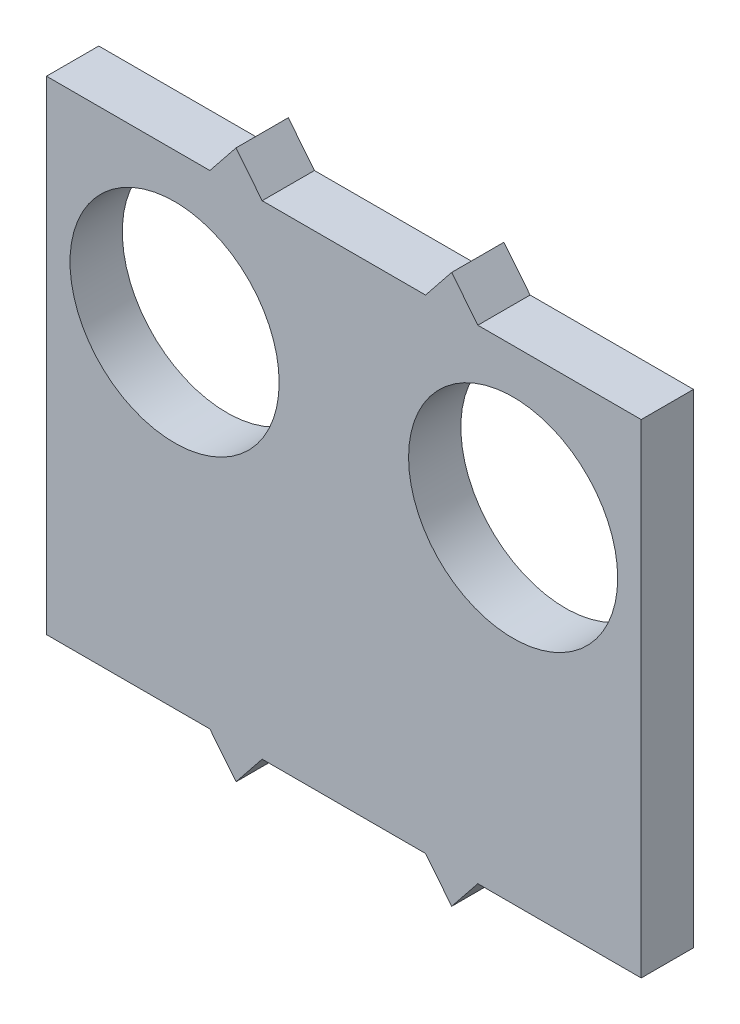
ISO-10303-21;
HEADER;
FILE_DESCRIPTION(('STEP AP214'),'2;1');
FILE_NAME('part.step','',(''),(''),'','','');
FILE_SCHEMA(('AUTOMOTIVE_DESIGN { 1 0 10303 214 1 1 1 1 }'));
ENDSEC;
DATA;
#1=APPLICATION_CONTEXT('core data for automotive mechanical design processes');
#2=APPLICATION_PROTOCOL_DEFINITION('international standard','automotive_design',2000,#1);
#3=PRODUCT_CONTEXT('',#1,'mechanical');
#4=PRODUCT('Part','Part','',(#3));
#5=PRODUCT_RELATED_PRODUCT_CATEGORY('part','',(#4));
#6=PRODUCT_DEFINITION_FORMATION('','',#4);
#7=PRODUCT_DEFINITION_CONTEXT('part definition',#1,'design');
#8=PRODUCT_DEFINITION('design','',#6,#7);
#9=PRODUCT_DEFINITION_SHAPE('','',#8);
#10=(LENGTH_UNIT() NAMED_UNIT(*) SI_UNIT(.MILLI.,.METRE.));
#11=(NAMED_UNIT(*) PLANE_ANGLE_UNIT() SI_UNIT($,.RADIAN.));
#12=(NAMED_UNIT(*) SI_UNIT($,.STERADIAN.) SOLID_ANGLE_UNIT());
#13=UNCERTAINTY_MEASURE_WITH_UNIT(LENGTH_MEASURE(1.E-05),#10,'distance_accuracy_value','');
#14=(GEOMETRIC_REPRESENTATION_CONTEXT(3) GLOBAL_UNCERTAINTY_ASSIGNED_CONTEXT((#13)) GLOBAL_UNIT_ASSIGNED_CONTEXT((#10,
#11,#12)) REPRESENTATION_CONTEXT('',''));
#15=CARTESIAN_POINT('',(0.,0.,0.));
#16=DIRECTION('',(0.,0.,1.));
#17=DIRECTION('',(1.,0.,0.));
#18=AXIS2_PLACEMENT_3D('',#15,#16,#17);
#19=CARTESIAN_POINT('',(0.,0.,4.));
#20=DIRECTION('',(0.,1.,0.));
#21=DIRECTION('',(0.,0.,1.));
#22=AXIS2_PLACEMENT_3D('',#19,#20,#21);
#23=PLANE('',#22);
#24=DIRECTION('',(1.,0.,0.));
#25=VECTOR('',#24,1.);
#26=CARTESIAN_POINT('',(0.,0.,0.));
#27=LINE('',#26,#25);
#28=CARTESIAN_POINT('',(0.,0.,0.));
#29=VERTEX_POINT('',#28);
#30=CARTESIAN_POINT('',(12.5,0.,0.));
#31=VERTEX_POINT('',#30);
#32=EDGE_CURVE('E224',#29,#31,#27,.T.);
#33=ORIENTED_EDGE('',*,*,#32,.T.);
#34=DIRECTION('',(0.,0.,-1.));
#35=VECTOR('',#34,1.);
#36=CARTESIAN_POINT('',(12.5,0.,4.));
#37=LINE('',#36,#35);
#38=CARTESIAN_POINT('',(12.5,0.,4.));
#39=VERTEX_POINT('',#38);
#40=EDGE_CURVE('E11',#39,#31,#37,.T.);
#41=ORIENTED_EDGE('',*,*,#40,.F.);
#42=DIRECTION('',(1.,0.,0.));
#43=VECTOR('',#42,1.);
#44=CARTESIAN_POINT('',(0.,0.,4.));
#45=LINE('',#44,#43);
#46=CARTESIAN_POINT('',(0.,0.,4.));
#47=VERTEX_POINT('',#46);
#48=EDGE_CURVE('E203',#47,#39,#45,.T.);
#49=ORIENTED_EDGE('',*,*,#48,.F.);
#50=DIRECTION('',(0.,0.,-1.));
#51=VECTOR('',#50,1.);
#52=CARTESIAN_POINT('',(0.,0.,4.));
#53=LINE('',#52,#51);
#54=EDGE_CURVE('E59',#47,#29,#53,.T.);
#55=ORIENTED_EDGE('',*,*,#54,.T.);
#56=EDGE_LOOP('',(#33,#41,#49,#55));
#57=FACE_BOUND('',#56,.T.);
#58=ADVANCED_FACE('F42',(#57),#23,.F.);
#59=CARTESIAN_POINT('',(7.6219512195122,6.09756097560976,4.));
#60=DIRECTION('',(0.78086880944303,0.624695047554424,0.));
#61=DIRECTION('',(-0.624695047554424,0.78086880944303,0.));
#62=AXIS2_PLACEMENT_3D('',#59,#60,#61);
#63=PLANE('',#62);
#64=DIRECTION('',(0.624695047554424,-0.78086880944303,0.));
#65=VECTOR('',#64,1.);
#66=CARTESIAN_POINT('',(7.6219512195122,6.09756097560976,0.));
#67=LINE('',#66,#65);
#68=CARTESIAN_POINT('',(14.5,-2.5,0.));
#69=VERTEX_POINT('',#68);
#70=EDGE_CURVE('E341',#31,#69,#67,.T.);
#71=ORIENTED_EDGE('',*,*,#70,.T.);
#72=DIRECTION('',(0.,0.,-1.));
#73=VECTOR('',#72,1.);
#74=CARTESIAN_POINT('',(14.5,-2.5,4.));
#75=LINE('',#74,#73);
#76=CARTESIAN_POINT('',(14.5,-2.5,4.));
#77=VERTEX_POINT('',#76);
#78=EDGE_CURVE('E51',#77,#69,#75,.T.);
#79=ORIENTED_EDGE('',*,*,#78,.F.);
#80=DIRECTION('',(0.624695047554424,-0.78086880944303,0.));
#81=VECTOR('',#80,1.);
#82=CARTESIAN_POINT('',(7.6219512195122,6.09756097560976,4.));
#83=LINE('',#82,#81);
#84=EDGE_CURVE('E121',#39,#77,#83,.T.);
#85=ORIENTED_EDGE('',*,*,#84,.F.);
#86=ORIENTED_EDGE('',*,*,#40,.T.);
#87=EDGE_LOOP('',(#71,#79,#85,#86));
#88=FACE_BOUND('',#87,.T.);
#89=ADVANCED_FACE('F44',(#88),#63,.F.);
#90=CARTESIAN_POINT('',(10.0609756097561,-8.04878048780488,4.));
#91=DIRECTION('',(-0.780868809443031,0.624695047554424,0.));
#92=DIRECTION('',(-0.624695047554424,-0.780868809443031,0.));
#93=AXIS2_PLACEMENT_3D('',#90,#91,#92);
#94=PLANE('',#93);
#95=DIRECTION('',(0.624695047554424,0.780868809443031,0.));
#96=VECTOR('',#95,1.);
#97=CARTESIAN_POINT('',(10.0609756097561,-8.04878048780488,0.));
#98=LINE('',#97,#96);
#99=CARTESIAN_POINT('',(16.5,0.,0.));
#100=VERTEX_POINT('',#99);
#101=EDGE_CURVE('E339',#69,#100,#98,.T.);
#102=ORIENTED_EDGE('',*,*,#101,.T.);
#103=DIRECTION('',(0.,0.,-1.));
#104=VECTOR('',#103,1.);
#105=CARTESIAN_POINT('',(16.5,0.,4.));
#106=LINE('',#105,#104);
#107=CARTESIAN_POINT('',(16.5,0.,4.));
#108=VERTEX_POINT('',#107);
#109=EDGE_CURVE('E332',#108,#100,#106,.T.);
#110=ORIENTED_EDGE('',*,*,#109,.F.);
#111=DIRECTION('',(0.624695047554424,0.780868809443031,0.));
#112=VECTOR('',#111,1.);
#113=CARTESIAN_POINT('',(10.0609756097561,-8.04878048780488,4.));
#114=LINE('',#113,#112);
#115=EDGE_CURVE('E210',#77,#108,#114,.T.);
#116=ORIENTED_EDGE('',*,*,#115,.F.);
#117=ORIENTED_EDGE('',*,*,#78,.T.);
#118=EDGE_LOOP('',(#102,#110,#116,#117));
#119=FACE_BOUND('',#118,.T.);
#120=ADVANCED_FACE('F257',(#119),#94,.F.);
#121=CARTESIAN_POINT('',(29.,0.,0.));
#122=VERTEX_POINT('',#121);
#123=EDGE_CURVE('E288',#100,#122,#27,.T.);
#124=ORIENTED_EDGE('',*,*,#123,.T.);
#125=DIRECTION('',(0.,0.,-1.));
#126=VECTOR('',#125,1.);
#127=CARTESIAN_POINT('',(29.,0.,4.));
#128=LINE('',#127,#126);
#129=CARTESIAN_POINT('',(29.,0.,4.));
#130=VERTEX_POINT('',#129);
#131=EDGE_CURVE('E330',#130,#122,#128,.T.);
#132=ORIENTED_EDGE('',*,*,#131,.F.);
#133=EDGE_CURVE('E202',#108,#130,#45,.T.);
#134=ORIENTED_EDGE('',*,*,#133,.F.);
#135=ORIENTED_EDGE('',*,*,#109,.T.);
#136=EDGE_LOOP('',(#124,#132,#134,#135));
#137=FACE_BOUND('',#136,.T.);
#138=ADVANCED_FACE('F252',(#137),#23,.F.);
#139=CARTESIAN_POINT('',(17.6829268292683,14.1463414634146,4.));
#140=DIRECTION('',(-0.78086880944303,-0.624695047554424,0.));
#141=DIRECTION('',(0.624695047554424,-0.78086880944303,0.));
#142=AXIS2_PLACEMENT_3D('',#139,#140,#141);
#143=PLANE('',#142);
#144=DIRECTION('',(-0.624695047554424,0.78086880944303,0.));
#145=VECTOR('',#144,1.);
#146=CARTESIAN_POINT('',(17.6829268292683,14.1463414634146,0.));
#147=LINE('',#146,#145);
#148=CARTESIAN_POINT('',(31.,-2.5,0.));
#149=VERTEX_POINT('',#148);
#150=EDGE_CURVE('E345',#149,#122,#147,.T.);
#151=ORIENTED_EDGE('',*,*,#150,.F.);
#152=DIRECTION('',(0.,0.,-1.));
#153=VECTOR('',#152,1.);
#154=CARTESIAN_POINT('',(31.,-2.5,4.));
#155=LINE('',#154,#153);
#156=CARTESIAN_POINT('',(31.,-2.5,4.));
#157=VERTEX_POINT('',#156);
#158=EDGE_CURVE('E328',#157,#149,#155,.T.);
#159=ORIENTED_EDGE('',*,*,#158,.F.);
#160=DIRECTION('',(-0.624695047554424,0.78086880944303,0.));
#161=VECTOR('',#160,1.);
#162=CARTESIAN_POINT('',(17.6829268292683,14.1463414634146,4.));
#163=LINE('',#162,#161);
#164=EDGE_CURVE('E207',#157,#130,#163,.T.);
#165=ORIENTED_EDGE('',*,*,#164,.T.);
#166=ORIENTED_EDGE('',*,*,#131,.T.);
#167=EDGE_LOOP('',(#151,#159,#165,#166));
#168=FACE_BOUND('',#167,.T.);
#169=ADVANCED_FACE('F261',(#168),#143,.T.);
#170=CARTESIAN_POINT('',(20.1219512195122,-16.0975609756098,4.));
#171=DIRECTION('',(0.78086880944303,-0.624695047554424,0.));
#172=DIRECTION('',(0.624695047554424,0.78086880944303,0.));
#173=AXIS2_PLACEMENT_3D('',#170,#171,#172);
#174=PLANE('',#173);
#175=DIRECTION('',(-0.624695047554424,-0.78086880944303,0.));
#176=VECTOR('',#175,1.);
#177=CARTESIAN_POINT('',(20.1219512195122,-16.0975609756098,0.));
#178=LINE('',#177,#176);
#179=CARTESIAN_POINT('',(33.,0.,0.));
#180=VERTEX_POINT('',#179);
#181=EDGE_CURVE('E286',#180,#149,#178,.T.);
#182=ORIENTED_EDGE('',*,*,#181,.F.);
#183=DIRECTION('',(0.,0.,-1.));
#184=VECTOR('',#183,1.);
#185=CARTESIAN_POINT('',(33.,0.,4.));
#186=LINE('',#185,#184);
#187=CARTESIAN_POINT('',(33.,0.,4.));
#188=VERTEX_POINT('',#187);
#189=EDGE_CURVE('E280',#188,#180,#186,.T.);
#190=ORIENTED_EDGE('',*,*,#189,.F.);
#191=DIRECTION('',(-0.624695047554424,-0.78086880944303,0.));
#192=VECTOR('',#191,1.);
#193=CARTESIAN_POINT('',(20.1219512195122,-16.0975609756098,4.));
#194=LINE('',#193,#192);
#195=EDGE_CURVE('E200',#188,#157,#194,.T.);
#196=ORIENTED_EDGE('',*,*,#195,.T.);
#197=ORIENTED_EDGE('',*,*,#158,.T.);
#198=EDGE_LOOP('',(#182,#190,#196,#197));
#199=FACE_BOUND('',#198,.T.);
#200=ADVANCED_FACE('F265',(#199),#174,.T.);
#201=CARTESIAN_POINT('',(45.5,0.,0.));
#202=VERTEX_POINT('',#201);
#203=EDGE_CURVE('E276',#180,#202,#27,.T.);
#204=ORIENTED_EDGE('',*,*,#203,.T.);
#205=DIRECTION('',(0.,0.,-1.));
#206=VECTOR('',#205,1.);
#207=CARTESIAN_POINT('',(45.5,0.,4.));
#208=LINE('',#207,#206);
#209=CARTESIAN_POINT('',(45.5,0.,4.));
#210=VERTEX_POINT('',#209);
#211=EDGE_CURVE('E279',#210,#202,#208,.T.);
#212=ORIENTED_EDGE('',*,*,#211,.F.);
#213=EDGE_CURVE('E197',#188,#210,#45,.T.);
#214=ORIENTED_EDGE('',*,*,#213,.F.);
#215=ORIENTED_EDGE('',*,*,#189,.T.);
#216=EDGE_LOOP('',(#204,#212,#214,#215));
#217=FACE_BOUND('',#216,.T.);
#218=ADVANCED_FACE('F253',(#217),#23,.F.);
#219=CARTESIAN_POINT('',(45.5,0.,4.));
#220=DIRECTION('',(-1.,0.,0.));
#221=DIRECTION('',(0.,0.,1.));
#222=AXIS2_PLACEMENT_3D('',#219,#220,#221);
#223=PLANE('',#222);
#224=DIRECTION('',(0.,1.,0.));
#225=VECTOR('',#224,1.);
#226=CARTESIAN_POINT('',(45.5,0.,0.));
#227=LINE('',#226,#225);
#228=CARTESIAN_POINT('',(45.5,37.,0.));
#229=VERTEX_POINT('',#228);
#230=EDGE_CURVE('E285',#202,#229,#227,.T.);
#231=ORIENTED_EDGE('',*,*,#230,.T.);
#232=DIRECTION('',(0.,0.,-1.));
#233=VECTOR('',#232,1.);
#234=CARTESIAN_POINT('',(45.5,37.,4.));
#235=LINE('',#234,#233);
#236=CARTESIAN_POINT('',(45.5,37.,4.));
#237=VERTEX_POINT('',#236);
#238=EDGE_CURVE('E291',#237,#229,#235,.T.);
#239=ORIENTED_EDGE('',*,*,#238,.F.);
#240=DIRECTION('',(0.,1.,0.));
#241=VECTOR('',#240,1.);
#242=CARTESIAN_POINT('',(45.5,0.,4.));
#243=LINE('',#242,#241);
#244=EDGE_CURVE('E194',#210,#237,#243,.T.);
#245=ORIENTED_EDGE('',*,*,#244,.F.);
#246=ORIENTED_EDGE('',*,*,#211,.T.);
#247=EDGE_LOOP('',(#231,#239,#245,#246));
#248=FACE_BOUND('',#247,.T.);
#249=ADVANCED_FACE('F264',(#248),#223,.F.);
#250=CARTESIAN_POINT('',(0.,37.,4.));
#251=DIRECTION('',(0.,1.,0.));
#252=DIRECTION('',(-1.,0.,0.));
#253=AXIS2_PLACEMENT_3D('',#250,#251,#252);
#254=PLANE('',#253);
#255=DIRECTION('',(1.,0.,0.));
#256=VECTOR('',#255,1.);
#257=CARTESIAN_POINT('',(0.,37.,0.));
#258=LINE('',#257,#256);
#259=CARTESIAN_POINT('',(33.,37.,0.));
#260=VERTEX_POINT('',#259);
#261=EDGE_CURVE('E295',#260,#229,#258,.T.);
#262=ORIENTED_EDGE('',*,*,#261,.F.);
#263=DIRECTION('',(0.,0.,-1.));
#264=VECTOR('',#263,1.);
#265=CARTESIAN_POINT('',(33.,37.,4.));
#266=LINE('',#265,#264);
#267=CARTESIAN_POINT('',(33.,37.,4.));
#268=VERTEX_POINT('',#267);
#269=EDGE_CURVE('E324',#268,#260,#266,.T.);
#270=ORIENTED_EDGE('',*,*,#269,.F.);
#271=DIRECTION('',(1.,0.,0.));
#272=VECTOR('',#271,1.);
#273=CARTESIAN_POINT('',(0.,37.,4.));
#274=LINE('',#273,#272);
#275=EDGE_CURVE('E186',#268,#237,#274,.T.);
#276=ORIENTED_EDGE('',*,*,#275,.T.);
#277=ORIENTED_EDGE('',*,*,#238,.T.);
#278=EDGE_LOOP('',(#262,#270,#276,#277));
#279=FACE_BOUND('',#278,.T.);
#280=ADVANCED_FACE('F271',(#279),#254,.T.);
#281=CARTESIAN_POINT('',(38.1707317073171,30.5365853658537,4.));
#282=DIRECTION('',(-0.78086880944303,-0.624695047554424,0.));
#283=DIRECTION('',(0.624695047554424,-0.78086880944303,0.));
#284=AXIS2_PLACEMENT_3D('',#281,#282,#283);
#285=PLANE('',#284);
#286=DIRECTION('',(-0.624695047554424,0.78086880944303,0.));
#287=VECTOR('',#286,1.);
#288=CARTESIAN_POINT('',(38.1707317073171,30.5365853658537,0.));
#289=LINE('',#288,#287);
#290=CARTESIAN_POINT('',(31.,39.5,0.));
#291=VERTEX_POINT('',#290);
#292=EDGE_CURVE('E297',#260,#291,#289,.T.);
#293=ORIENTED_EDGE('',*,*,#292,.T.);
#294=DIRECTION('',(0.,0.,-1.));
#295=VECTOR('',#294,1.);
#296=CARTESIAN_POINT('',(31.,39.5,4.));
#297=LINE('',#296,#295);
#298=CARTESIAN_POINT('',(31.,39.5,4.));
#299=VERTEX_POINT('',#298);
#300=EDGE_CURVE('E321',#299,#291,#297,.T.);
#301=ORIENTED_EDGE('',*,*,#300,.F.);
#302=DIRECTION('',(-0.624695047554424,0.78086880944303,0.));
#303=VECTOR('',#302,1.);
#304=CARTESIAN_POINT('',(38.1707317073171,30.5365853658537,4.));
#305=LINE('',#304,#303);
#306=EDGE_CURVE('E193',#268,#299,#305,.T.);
#307=ORIENTED_EDGE('',*,*,#306,.F.);
#308=ORIENTED_EDGE('',*,*,#269,.T.);
#309=EDGE_LOOP('',(#293,#301,#307,#308));
#310=FACE_BOUND('',#309,.T.);
#311=ADVANCED_FACE('F371',(#310),#285,.F.);
#312=CARTESIAN_POINT('',(-0.365853658536584,0.292682926829267,4.));
#313=DIRECTION('',(0.78086880944303,-0.624695047554424,0.));
#314=DIRECTION('',(0.624695047554424,0.78086880944303,0.));
#315=AXIS2_PLACEMENT_3D('',#312,#313,#314);
#316=PLANE('',#315);
#317=DIRECTION('',(-0.624695047554424,-0.78086880944303,0.));
#318=VECTOR('',#317,1.);
#319=CARTESIAN_POINT('',(-0.365853658536584,0.292682926829267,0.));
#320=LINE('',#319,#318);
#321=CARTESIAN_POINT('',(29.,37.,0.));
#322=VERTEX_POINT('',#321);
#323=EDGE_CURVE('E305',#291,#322,#320,.T.);
#324=ORIENTED_EDGE('',*,*,#323,.T.);
#325=DIRECTION('',(0.,0.,-1.));
#326=VECTOR('',#325,1.);
#327=CARTESIAN_POINT('',(29.,37.,4.));
#328=LINE('',#327,#326);
#329=CARTESIAN_POINT('',(29.,37.,4.));
#330=VERTEX_POINT('',#329);
#331=EDGE_CURVE('E319',#330,#322,#328,.T.);
#332=ORIENTED_EDGE('',*,*,#331,.F.);
#333=DIRECTION('',(-0.624695047554424,-0.78086880944303,0.));
#334=VECTOR('',#333,1.);
#335=CARTESIAN_POINT('',(-0.365853658536584,0.292682926829267,4.));
#336=LINE('',#335,#334);
#337=EDGE_CURVE('E191',#299,#330,#336,.T.);
#338=ORIENTED_EDGE('',*,*,#337,.F.);
#339=ORIENTED_EDGE('',*,*,#300,.T.);
#340=EDGE_LOOP('',(#324,#332,#338,#339));
#341=FACE_BOUND('',#340,.T.);
#342=ADVANCED_FACE('F361',(#341),#316,.F.);
#343=CARTESIAN_POINT('',(16.5,37.,0.));
#344=VERTEX_POINT('',#343);
#345=EDGE_CURVE('E300',#344,#322,#258,.T.);
#346=ORIENTED_EDGE('',*,*,#345,.F.);
#347=DIRECTION('',(0.,0.,-1.));
#348=VECTOR('',#347,1.);
#349=CARTESIAN_POINT('',(16.5,37.,4.));
#350=LINE('',#349,#348);
#351=CARTESIAN_POINT('',(16.5,37.,4.));
#352=VERTEX_POINT('',#351);
#353=EDGE_CURVE('E317',#352,#344,#350,.T.);
#354=ORIENTED_EDGE('',*,*,#353,.F.);
#355=EDGE_CURVE('E185',#352,#330,#274,.T.);
#356=ORIENTED_EDGE('',*,*,#355,.T.);
#357=ORIENTED_EDGE('',*,*,#331,.T.);
#358=EDGE_LOOP('',(#346,#354,#356,#357));
#359=FACE_BOUND('',#358,.T.);
#360=ADVANCED_FACE('F366',(#359),#254,.T.);
#361=CARTESIAN_POINT('',(28.109756097561,22.4878048780488,4.));
#362=DIRECTION('',(0.78086880944303,0.624695047554424,0.));
#363=DIRECTION('',(-0.624695047554424,0.78086880944303,0.));
#364=AXIS2_PLACEMENT_3D('',#361,#362,#363);
#365=PLANE('',#364);
#366=DIRECTION('',(0.624695047554424,-0.78086880944303,0.));
#367=VECTOR('',#366,1.);
#368=CARTESIAN_POINT('',(28.109756097561,22.4878048780488,0.));
#369=LINE('',#368,#367);
#370=CARTESIAN_POINT('',(14.5,39.5,0.));
#371=VERTEX_POINT('',#370);
#372=EDGE_CURVE('E308',#371,#344,#369,.T.);
#373=ORIENTED_EDGE('',*,*,#372,.F.);
#374=DIRECTION('',(0.,0.,-1.));
#375=VECTOR('',#374,1.);
#376=CARTESIAN_POINT('',(14.5,39.5,4.));
#377=LINE('',#376,#375);
#378=CARTESIAN_POINT('',(14.5,39.5,4.));
#379=VERTEX_POINT('',#378);
#380=EDGE_CURVE('E170',#379,#371,#377,.T.);
#381=ORIENTED_EDGE('',*,*,#380,.F.);
#382=DIRECTION('',(0.624695047554424,-0.78086880944303,0.));
#383=VECTOR('',#382,1.);
#384=CARTESIAN_POINT('',(28.109756097561,22.4878048780488,4.));
#385=LINE('',#384,#383);
#386=EDGE_CURVE('E180',#379,#352,#385,.T.);
#387=ORIENTED_EDGE('',*,*,#386,.T.);
#388=ORIENTED_EDGE('',*,*,#353,.T.);
#389=EDGE_LOOP('',(#373,#381,#387,#388));
#390=FACE_BOUND('',#389,.T.);
#391=ADVANCED_FACE('F369',(#390),#365,.T.);
#392=CARTESIAN_POINT('',(-10.4268292682927,8.34146341463413,4.));
#393=DIRECTION('',(-0.780868809443031,0.624695047554424,0.));
#394=DIRECTION('',(-0.624695047554424,-0.780868809443031,0.));
#395=AXIS2_PLACEMENT_3D('',#392,#393,#394);
#396=PLANE('',#395);
#397=DIRECTION('',(0.624695047554424,0.780868809443031,0.));
#398=VECTOR('',#397,1.);
#399=CARTESIAN_POINT('',(-10.4268292682927,8.34146341463413,0.));
#400=LINE('',#399,#398);
#401=CARTESIAN_POINT('',(12.5,37.,0.));
#402=VERTEX_POINT('',#401);
#403=EDGE_CURVE('E166',#402,#371,#400,.T.);
#404=ORIENTED_EDGE('',*,*,#403,.F.);
#405=DIRECTION('',(0.,0.,-1.));
#406=VECTOR('',#405,1.);
#407=CARTESIAN_POINT('',(12.5,37.,4.));
#408=LINE('',#407,#406);
#409=CARTESIAN_POINT('',(12.5,37.,4.));
#410=VERTEX_POINT('',#409);
#411=EDGE_CURVE('E161',#410,#402,#408,.T.);
#412=ORIENTED_EDGE('',*,*,#411,.F.);
#413=DIRECTION('',(0.624695047554424,0.780868809443031,0.));
#414=VECTOR('',#413,1.);
#415=CARTESIAN_POINT('',(-10.4268292682927,8.34146341463413,4.));
#416=LINE('',#415,#414);
#417=EDGE_CURVE('E164',#410,#379,#416,.T.);
#418=ORIENTED_EDGE('',*,*,#417,.T.);
#419=ORIENTED_EDGE('',*,*,#380,.T.);
#420=EDGE_LOOP('',(#404,#412,#418,#419));
#421=FACE_BOUND('',#420,.T.);
#422=ADVANCED_FACE('F163',(#421),#396,.T.);
#423=CARTESIAN_POINT('',(0.,37.,0.));
#424=VERTEX_POINT('',#423);
#425=EDGE_CURVE('E299',#424,#402,#258,.T.);
#426=ORIENTED_EDGE('',*,*,#425,.F.);
#427=DIRECTION('',(0.,0.,-1.));
#428=VECTOR('',#427,1.);
#429=CARTESIAN_POINT('',(0.,37.,4.));
#430=LINE('',#429,#428);
#431=CARTESIAN_POINT('',(0.,37.,4.));
#432=VERTEX_POINT('',#431);
#433=EDGE_CURVE('E109',#432,#424,#430,.T.);
#434=ORIENTED_EDGE('',*,*,#433,.F.);
#435=EDGE_CURVE('E177',#432,#410,#274,.T.);
#436=ORIENTED_EDGE('',*,*,#435,.T.);
#437=ORIENTED_EDGE('',*,*,#411,.T.);
#438=EDGE_LOOP('',(#426,#434,#436,#437));
#439=FACE_BOUND('',#438,.T.);
#440=ADVANCED_FACE('F182',(#439),#254,.T.);
#441=CARTESIAN_POINT('',(0.,0.,4.));
#442=DIRECTION('',(-1.,0.,0.));
#443=DIRECTION('',(0.,0.,1.));
#444=AXIS2_PLACEMENT_3D('',#441,#442,#443);
#445=PLANE('',#444);
#446=DIRECTION('',(0.,1.,0.));
#447=VECTOR('',#446,1.);
#448=CARTESIAN_POINT('',(0.,0.,0.));
#449=LINE('',#448,#447);
#450=EDGE_CURVE('E213',#29,#424,#449,.T.);
#451=ORIENTED_EDGE('',*,*,#450,.F.);
#452=ORIENTED_EDGE('',*,*,#54,.F.);
#453=DIRECTION('',(0.,1.,0.));
#454=VECTOR('',#453,1.);
#455=CARTESIAN_POINT('',(0.,0.,4.));
#456=LINE('',#455,#454);
#457=EDGE_CURVE('E183',#47,#432,#456,.T.);
#458=ORIENTED_EDGE('',*,*,#457,.T.);
#459=ORIENTED_EDGE('',*,*,#433,.T.);
#460=EDGE_LOOP('',(#451,#452,#458,#459));
#461=FACE_BOUND('',#460,.T.);
#462=ADVANCED_FACE('F233',(#461),#445,.T.);
#463=CARTESIAN_POINT('',(0.,0.,4.));
#464=DIRECTION('',(0.,0.,1.));
#465=DIRECTION('',(1.,0.,0.));
#466=AXIS2_PLACEMENT_3D('',#463,#464,#465);
#467=PLANE('',#466);
#468=CARTESIAN_POINT('',(9.8,25.6,4.));
#469=DIRECTION('',(0.,0.,1.));
#470=DIRECTION('',(1.,0.,0.));
#471=AXIS2_PLACEMENT_3D('',#468,#469,#470);
#472=CIRCLE('',#471,8.);
#473=CARTESIAN_POINT('',(17.8,25.6,4.));
#474=VERTEX_POINT('',#473);
#475=EDGE_CURVE('E217',#474,#474,#472,.T.);
#476=ORIENTED_EDGE('',*,*,#475,.F.);
#477=EDGE_LOOP('',(#476));
#478=FACE_BOUND('',#477,.T.);
#479=CARTESIAN_POINT('',(35.7,25.6,4.));
#480=DIRECTION('',(0.,0.,1.));
#481=DIRECTION('',(-1.,0.,0.));
#482=AXIS2_PLACEMENT_3D('',#479,#480,#481);
#483=CIRCLE('',#482,8.);
#484=CARTESIAN_POINT('',(27.7,25.6,4.));
#485=VERTEX_POINT('',#484);
#486=EDGE_CURVE('E218',#485,#485,#483,.T.);
#487=ORIENTED_EDGE('',*,*,#486,.F.);
#488=EDGE_LOOP('',(#487));
#489=FACE_BOUND('',#488,.T.);
#490=ORIENTED_EDGE('',*,*,#48,.T.);
#491=ORIENTED_EDGE('',*,*,#84,.T.);
#492=ORIENTED_EDGE('',*,*,#115,.T.);
#493=ORIENTED_EDGE('',*,*,#133,.T.);
#494=ORIENTED_EDGE('',*,*,#164,.F.);
#495=ORIENTED_EDGE('',*,*,#195,.F.);
#496=ORIENTED_EDGE('',*,*,#213,.T.);
#497=ORIENTED_EDGE('',*,*,#244,.T.);
#498=ORIENTED_EDGE('',*,*,#275,.F.);
#499=ORIENTED_EDGE('',*,*,#306,.T.);
#500=ORIENTED_EDGE('',*,*,#337,.T.);
#501=ORIENTED_EDGE('',*,*,#355,.F.);
#502=ORIENTED_EDGE('',*,*,#386,.F.);
#503=ORIENTED_EDGE('',*,*,#417,.F.);
#504=ORIENTED_EDGE('',*,*,#435,.F.);
#505=ORIENTED_EDGE('',*,*,#457,.F.);
#506=EDGE_LOOP('',(#490,#491,#492,#493,#494,#495,#496,#497,#498,#499,#500,#501,#502,#503,#504,#505));
#507=FACE_BOUND('',#506,.T.);
#508=ADVANCED_FACE('F175',(#478,#489,#507),#467,.T.);
#509=CARTESIAN_POINT('',(0.,0.,0.));
#510=DIRECTION('',(0.,0.,1.));
#511=DIRECTION('',(1.,0.,0.));
#512=AXIS2_PLACEMENT_3D('',#509,#510,#511);
#513=PLANE('',#512);
#514=CARTESIAN_POINT('',(9.8,25.6,0.));
#515=DIRECTION('',(0.,0.,1.));
#516=DIRECTION('',(1.,0.,0.));
#517=AXIS2_PLACEMENT_3D('',#514,#515,#516);
#518=CIRCLE('',#517,8.);
#519=CARTESIAN_POINT('',(17.8,25.6,0.));
#520=VERTEX_POINT('',#519);
#521=EDGE_CURVE('E221',#520,#520,#518,.F.);
#522=ORIENTED_EDGE('',*,*,#521,.F.);
#523=EDGE_LOOP('',(#522));
#524=FACE_BOUND('',#523,.T.);
#525=CARTESIAN_POINT('',(35.7,25.6,0.));
#526=DIRECTION('',(0.,0.,1.));
#527=DIRECTION('',(1.,0.,0.));
#528=AXIS2_PLACEMENT_3D('',#525,#526,#527);
#529=CIRCLE('',#528,8.);
#530=CARTESIAN_POINT('',(43.7,25.6,0.));
#531=VERTEX_POINT('',#530);
#532=EDGE_CURVE('E214',#531,#531,#529,.F.);
#533=ORIENTED_EDGE('',*,*,#532,.F.);
#534=EDGE_LOOP('',(#533));
#535=FACE_BOUND('',#534,.T.);
#536=ORIENTED_EDGE('',*,*,#32,.F.);
#537=ORIENTED_EDGE('',*,*,#450,.T.);
#538=ORIENTED_EDGE('',*,*,#425,.T.);
#539=ORIENTED_EDGE('',*,*,#403,.T.);
#540=ORIENTED_EDGE('',*,*,#372,.T.);
#541=ORIENTED_EDGE('',*,*,#345,.T.);
#542=ORIENTED_EDGE('',*,*,#323,.F.);
#543=ORIENTED_EDGE('',*,*,#292,.F.);
#544=ORIENTED_EDGE('',*,*,#261,.T.);
#545=ORIENTED_EDGE('',*,*,#230,.F.);
#546=ORIENTED_EDGE('',*,*,#203,.F.);
#547=ORIENTED_EDGE('',*,*,#181,.T.);
#548=ORIENTED_EDGE('',*,*,#150,.T.);
#549=ORIENTED_EDGE('',*,*,#123,.F.);
#550=ORIENTED_EDGE('',*,*,#101,.F.);
#551=ORIENTED_EDGE('',*,*,#70,.F.);
#552=EDGE_LOOP('',(#536,#537,#538,#539,#540,#541,#542,#543,#544,#545,#546,#547,#548,#549,#550,#551));
#553=FACE_BOUND('',#552,.T.);
#554=ADVANCED_FACE('F232',(#524,#535,#553),#513,.F.);
#555=CARTESIAN_POINT('',(35.7,25.6,-22.6274169979695));
#556=DIRECTION('',(0.,0.,1.));
#557=DIRECTION('',(1.,0.,0.));
#558=AXIS2_PLACEMENT_3D('',#555,#556,#557);
#559=CYLINDRICAL_SURFACE('',#558,8.);
#560=ORIENTED_EDGE('',*,*,#532,.T.);
#561=EDGE_LOOP('',(#560));
#562=FACE_BOUND('',#561,.T.);
#563=ORIENTED_EDGE('',*,*,#486,.T.);
#564=EDGE_LOOP('',(#563));
#565=FACE_BOUND('',#564,.T.);
#566=ADVANCED_FACE('F237',(#562,#565),#559,.F.);
#567=CARTESIAN_POINT('',(9.8,25.6,-22.6274169979695));
#568=DIRECTION('',(0.,0.,1.));
#569=DIRECTION('',(1.,0.,0.));
#570=AXIS2_PLACEMENT_3D('',#567,#568,#569);
#571=CYLINDRICAL_SURFACE('',#570,8.);
#572=ORIENTED_EDGE('',*,*,#521,.T.);
#573=EDGE_LOOP('',(#572));
#574=FACE_BOUND('',#573,.T.);
#575=ORIENTED_EDGE('',*,*,#475,.T.);
#576=EDGE_LOOP('',(#575));
#577=FACE_BOUND('',#576,.T.);
#578=ADVANCED_FACE('F228',(#574,#577),#571,.F.);
#579=CLOSED_SHELL('',(#58,#89,#120,#138,#169,#200,#218,#249,#280,#311,#342,#360,#391,#422,#440,
#462,#508,#554,#566,#578));
#580=MANIFOLD_SOLID_BREP('B2',#579);
#581=ADVANCED_BREP_SHAPE_REPRESENTATION('',(#18,#580),#14);
#582=SHAPE_DEFINITION_REPRESENTATION(#9,#581);
ENDSEC;
END-ISO-10303-21;
